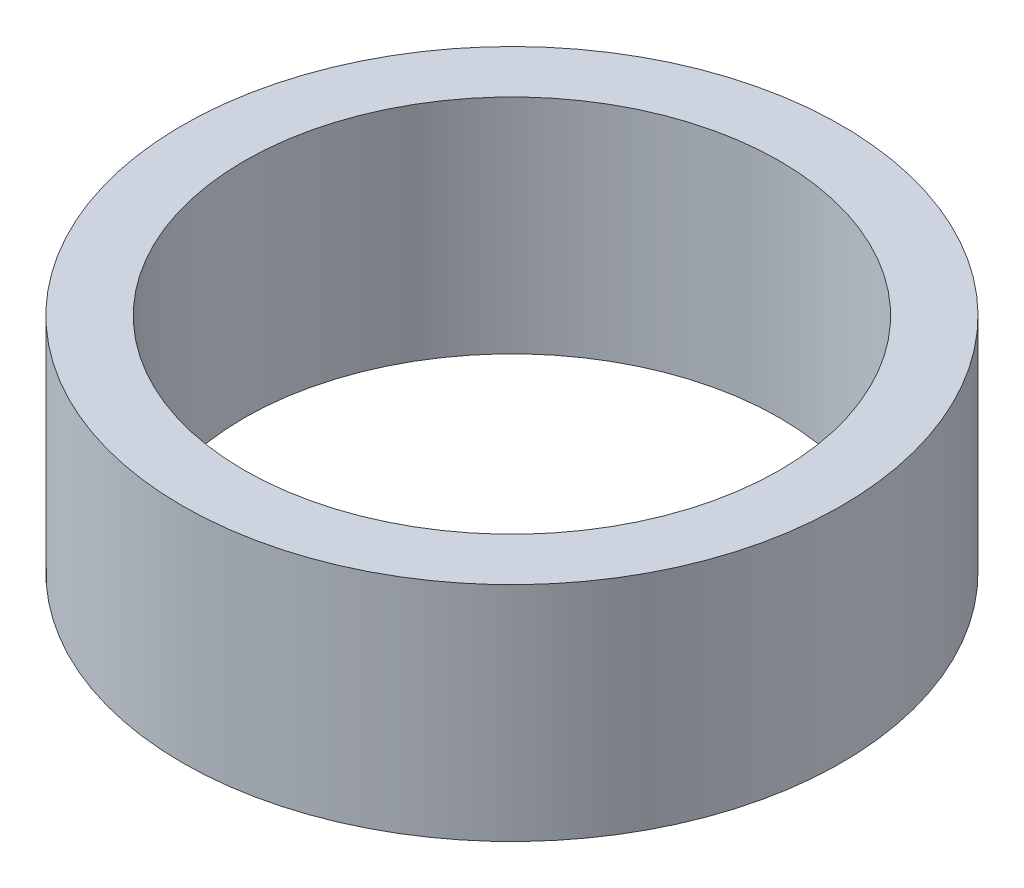
ISO-10303-21;
HEADER;
FILE_DESCRIPTION(('STEP AP214'),'2;1');
FILE_NAME('part.step','',(''),(''),'','','');
FILE_SCHEMA(('AUTOMOTIVE_DESIGN { 1 0 10303 214 1 1 1 1 }'));
ENDSEC;
DATA;
#1=APPLICATION_CONTEXT('core data for automotive mechanical design processes');
#2=APPLICATION_PROTOCOL_DEFINITION('international standard','automotive_design',2000,#1);
#3=PRODUCT_CONTEXT('',#1,'mechanical');
#4=PRODUCT('Part','Part','',(#3));
#5=PRODUCT_RELATED_PRODUCT_CATEGORY('part','',(#4));
#6=PRODUCT_DEFINITION_FORMATION('','',#4);
#7=PRODUCT_DEFINITION_CONTEXT('part definition',#1,'design');
#8=PRODUCT_DEFINITION('design','',#6,#7);
#9=PRODUCT_DEFINITION_SHAPE('','',#8);
#10=(LENGTH_UNIT() NAMED_UNIT(*) SI_UNIT(.MILLI.,.METRE.));
#11=(NAMED_UNIT(*) PLANE_ANGLE_UNIT() SI_UNIT($,.RADIAN.));
#12=(NAMED_UNIT(*) SI_UNIT($,.STERADIAN.) SOLID_ANGLE_UNIT());
#13=UNCERTAINTY_MEASURE_WITH_UNIT(LENGTH_MEASURE(1.E-05),#10,'distance_accuracy_value','');
#14=(GEOMETRIC_REPRESENTATION_CONTEXT(3) GLOBAL_UNCERTAINTY_ASSIGNED_CONTEXT((#13)) GLOBAL_UNIT_ASSIGNED_CONTEXT((#10,
#11,#12)) REPRESENTATION_CONTEXT('',''));
#15=CARTESIAN_POINT('',(0.,0.,0.));
#16=DIRECTION('',(0.,0.,1.));
#17=DIRECTION('',(1.,0.,0.));
#18=AXIS2_PLACEMENT_3D('',#15,#16,#17);
#19=CARTESIAN_POINT('',(0.,27.,0.));
#20=DIRECTION('',(0.,-1.,0.));
#21=DIRECTION('',(0.,0.,-1.));
#22=AXIS2_PLACEMENT_3D('',#19,#20,#21);
#23=CYLINDRICAL_SURFACE('',#22,40.);
#24=CARTESIAN_POINT('',(0.,27.,0.));
#25=DIRECTION('',(0.,1.,0.));
#26=DIRECTION('',(0.,0.,1.));
#27=AXIS2_PLACEMENT_3D('',#24,#25,#26);
#28=CIRCLE('',#27,40.);
#29=CARTESIAN_POINT('',(0.,27.,40.));
#30=VERTEX_POINT('',#29);
#31=EDGE_CURVE('E10',#30,#30,#28,.T.);
#32=ORIENTED_EDGE('',*,*,#31,.F.);
#33=EDGE_LOOP('',(#32));
#34=FACE_BOUND('',#33,.T.);
#35=CARTESIAN_POINT('',(0.,0.,0.));
#36=DIRECTION('',(0.,1.,0.));
#37=DIRECTION('',(0.,0.,1.));
#38=AXIS2_PLACEMENT_3D('',#35,#36,#37);
#39=CIRCLE('',#38,40.);
#40=CARTESIAN_POINT('',(0.,0.,40.));
#41=VERTEX_POINT('',#40);
#42=EDGE_CURVE('E37',#41,#41,#39,.T.);
#43=ORIENTED_EDGE('',*,*,#42,.T.);
#44=EDGE_LOOP('',(#43));
#45=FACE_BOUND('',#44,.T.);
#46=ADVANCED_FACE('F40',(#34,#45),#23,.T.);
#47=CARTESIAN_POINT('',(0.,27.,0.));
#48=DIRECTION('',(0.,1.,0.));
#49=DIRECTION('',(0.,0.,1.));
#50=AXIS2_PLACEMENT_3D('',#47,#48,#49);
#51=PLANE('',#50);
#52=CARTESIAN_POINT('',(0.,27.,0.));
#53=DIRECTION('',(0.,1.,0.));
#54=DIRECTION('',(0.,0.,1.));
#55=AXIS2_PLACEMENT_3D('',#52,#53,#54);
#56=CIRCLE('',#55,32.5);
#57=CARTESIAN_POINT('',(0.,27.,32.5));
#58=VERTEX_POINT('',#57);
#59=EDGE_CURVE('E50',#58,#58,#56,.T.);
#60=ORIENTED_EDGE('',*,*,#59,.F.);
#61=EDGE_LOOP('',(#60));
#62=FACE_BOUND('',#61,.T.);
#63=ORIENTED_EDGE('',*,*,#31,.T.);
#64=EDGE_LOOP('',(#63));
#65=FACE_BOUND('',#64,.T.);
#66=ADVANCED_FACE('F59',(#62,#65),#51,.T.);
#67=CARTESIAN_POINT('',(0.,0.,0.));
#68=DIRECTION('',(0.,1.,0.));
#69=DIRECTION('',(0.,0.,1.));
#70=AXIS2_PLACEMENT_3D('',#67,#68,#69);
#71=PLANE('',#70);
#72=CARTESIAN_POINT('',(0.,0.,0.));
#73=DIRECTION('',(0.,1.,0.));
#74=DIRECTION('',(0.,0.,1.));
#75=AXIS2_PLACEMENT_3D('',#72,#73,#74);
#76=CIRCLE('',#75,32.5);
#77=CARTESIAN_POINT('',(0.,0.,32.5));
#78=VERTEX_POINT('',#77);
#79=EDGE_CURVE('E47',#78,#78,#76,.T.);
#80=ORIENTED_EDGE('',*,*,#79,.T.);
#81=EDGE_LOOP('',(#80));
#82=FACE_BOUND('',#81,.T.);
#83=ORIENTED_EDGE('',*,*,#42,.F.);
#84=EDGE_LOOP('',(#83));
#85=FACE_BOUND('',#84,.T.);
#86=ADVANCED_FACE('F58',(#82,#85),#71,.F.);
#87=CARTESIAN_POINT('',(0.,27.,0.));
#88=DIRECTION('',(0.,-1.,0.));
#89=DIRECTION('',(0.,0.,-1.));
#90=AXIS2_PLACEMENT_3D('',#87,#88,#89);
#91=CYLINDRICAL_SURFACE('',#90,32.5);
#92=ORIENTED_EDGE('',*,*,#59,.T.);
#93=EDGE_LOOP('',(#92));
#94=FACE_BOUND('',#93,.T.);
#95=ORIENTED_EDGE('',*,*,#79,.F.);
#96=EDGE_LOOP('',(#95));
#97=FACE_BOUND('',#96,.T.);
#98=ADVANCED_FACE('F54',(#94,#97),#91,.F.);
#99=CLOSED_SHELL('',(#46,#66,#86,#98));
#100=MANIFOLD_SOLID_BREP('B2',#99);
#101=ADVANCED_BREP_SHAPE_REPRESENTATION('',(#18,#100),#14);
#102=SHAPE_DEFINITION_REPRESENTATION(#9,#101);
ENDSEC;
END-ISO-10303-21;
